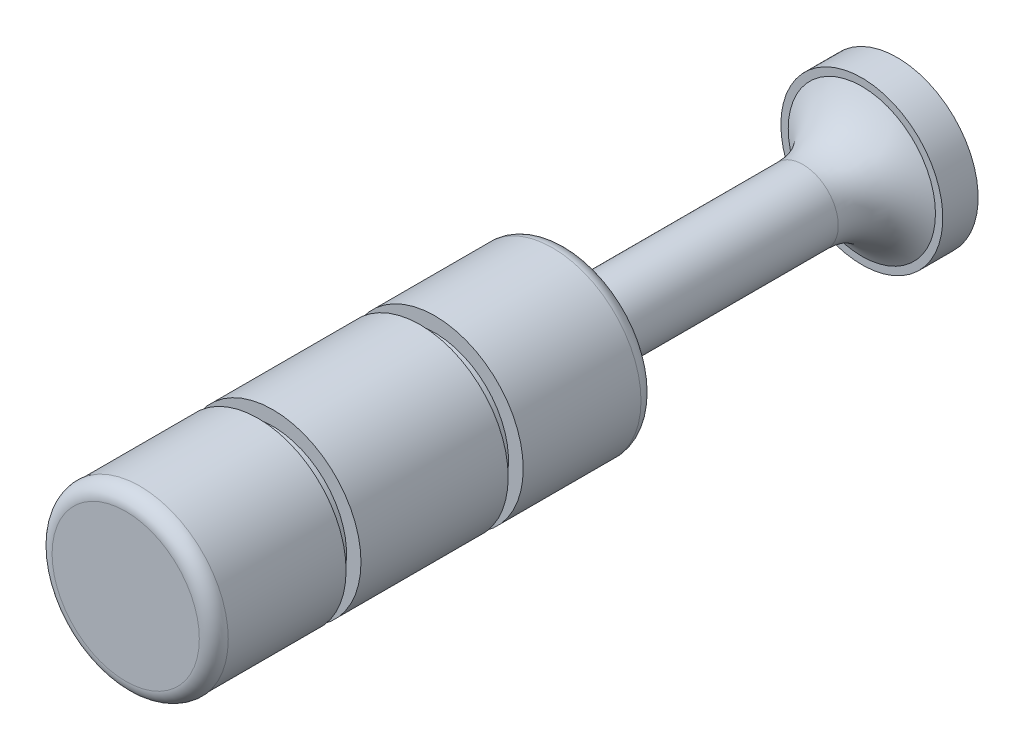
ISO-10303-21;
HEADER;
FILE_DESCRIPTION(('STEP AP214'),'2;1');
FILE_NAME('part.step','',(''),(''),'','','');
FILE_SCHEMA(('AUTOMOTIVE_DESIGN { 1 0 10303 214 1 1 1 1 }'));
ENDSEC;
DATA;
#1=APPLICATION_CONTEXT('core data for automotive mechanical design processes');
#2=APPLICATION_PROTOCOL_DEFINITION('international standard','automotive_design',2000,#1);
#3=PRODUCT_CONTEXT('',#1,'mechanical');
#4=PRODUCT('Part','Part','',(#3));
#5=PRODUCT_RELATED_PRODUCT_CATEGORY('part','',(#4));
#6=PRODUCT_DEFINITION_FORMATION('','',#4);
#7=PRODUCT_DEFINITION_CONTEXT('part definition',#1,'design');
#8=PRODUCT_DEFINITION('design','',#6,#7);
#9=PRODUCT_DEFINITION_SHAPE('','',#8);
#10=(LENGTH_UNIT() NAMED_UNIT(*) SI_UNIT(.MILLI.,.METRE.));
#11=(NAMED_UNIT(*) PLANE_ANGLE_UNIT() SI_UNIT($,.RADIAN.));
#12=(NAMED_UNIT(*) SI_UNIT($,.STERADIAN.) SOLID_ANGLE_UNIT());
#13=UNCERTAINTY_MEASURE_WITH_UNIT(LENGTH_MEASURE(1.E-05),#10,'distance_accuracy_value','');
#14=(GEOMETRIC_REPRESENTATION_CONTEXT(3) GLOBAL_UNCERTAINTY_ASSIGNED_CONTEXT((#13)) GLOBAL_UNIT_ASSIGNED_CONTEXT((#10,
#11,#12)) REPRESENTATION_CONTEXT('',''));
#15=CARTESIAN_POINT('',(0.,0.,0.));
#16=DIRECTION('',(0.,0.,1.));
#17=DIRECTION('',(1.,0.,0.));
#18=AXIS2_PLACEMENT_3D('',#15,#16,#17);
#19=CARTESIAN_POINT('',(0.,0.,-112.));
#20=DIRECTION('',(0.,0.,-1.));
#21=DIRECTION('',(-1.,0.,0.));
#22=AXIS2_PLACEMENT_3D('',#19,#20,#21);
#23=PLANE('',#22);
#24=CARTESIAN_POINT('',(0.,0.,-112.));
#25=DIRECTION('',(0.,0.,-1.));
#26=DIRECTION('',(-1.,0.,0.));
#27=AXIS2_PLACEMENT_3D('',#24,#25,#26);
#28=CIRCLE('',#27,27.5);
#29=CARTESIAN_POINT('',(-27.5,0.,-112.));
#30=VERTEX_POINT('',#29);
#31=EDGE_CURVE('E266',#30,#30,#28,.F.);
#32=ORIENTED_EDGE('',*,*,#31,.F.);
#33=EDGE_LOOP('',(#32));
#34=FACE_BOUND('',#33,.T.);
#35=ADVANCED_FACE('F16',(#34),#23,.T.);
#36=CARTESIAN_POINT('',(0.,0.,-100.));
#37=DIRECTION('',(0.,0.,-1.));
#38=DIRECTION('',(-1.,0.,0.));
#39=AXIS2_PLACEMENT_3D('',#36,#37,#38);
#40=CYLINDRICAL_SURFACE('',#39,27.5);
#41=ORIENTED_EDGE('',*,*,#31,.T.);
#42=EDGE_LOOP('',(#41));
#43=FACE_BOUND('',#42,.T.);
#44=CARTESIAN_POINT('',(0.,0.,-100.));
#45=DIRECTION('',(0.,0.,-1.));
#46=DIRECTION('',(-1.,0.,0.));
#47=AXIS2_PLACEMENT_3D('',#44,#45,#46);
#48=CIRCLE('',#47,27.5);
#49=CARTESIAN_POINT('',(-27.5,0.,-100.));
#50=VERTEX_POINT('',#49);
#51=EDGE_CURVE('E263',#50,#50,#48,.T.);
#52=ORIENTED_EDGE('',*,*,#51,.T.);
#53=EDGE_LOOP('',(#52));
#54=FACE_BOUND('',#53,.T.);
#55=ADVANCED_FACE('F182',(#43,#54),#40,.T.);
#56=CARTESIAN_POINT('',(0.,0.,-100.));
#57=DIRECTION('',(0.,0.,-1.));
#58=DIRECTION('',(-1.,0.,0.));
#59=AXIS2_PLACEMENT_3D('',#56,#57,#58);
#60=PLANE('',#59);
#61=CARTESIAN_POINT('',(0.,0.,-100.));
#62=DIRECTION('',(0.,0.,1.));
#63=DIRECTION('',(1.,0.,0.));
#64=AXIS2_PLACEMENT_3D('',#61,#62,#63);
#65=CIRCLE('',#64,24.9999999999631);
#66=CARTESIAN_POINT('',(24.9999999999631,0.,-100.));
#67=VERTEX_POINT('',#66);
#68=EDGE_CURVE('E168',#67,#67,#65,.T.);
#69=ORIENTED_EDGE('',*,*,#68,.F.);
#70=EDGE_LOOP('',(#69));
#71=FACE_BOUND('',#70,.T.);
#72=ORIENTED_EDGE('',*,*,#51,.F.);
#73=EDGE_LOOP('',(#72));
#74=FACE_BOUND('',#73,.T.);
#75=ADVANCED_FACE('F179',(#71,#74),#60,.F.);
#76=CARTESIAN_POINT('',(0.,12.00127129795,-79.74823270007));
#77=CARTESIAN_POINT('',(0.,12.00042317209,-79.83237085997));
#78=CARTESIAN_POINT('',(0.,11.97749377162,-84.3796697018));
#79=CARTESIAN_POINT('',(0.,14.47676341213,-92.40162845407));
#80=CARTESIAN_POINT('',(0.,20.99160255353,-97.88727807262));
#81=CARTESIAN_POINT('',(0.,25.14864100605,-100.0787003868));
#82=CARTESIAN_POINT('',(0.,25.22332574502,-100.1177295014));
#83=(BOUNDED_CURVE() B_SPLINE_CURVE(3,(#76,#77,#78,#79,#80,#81,#82),.UNSPECIFIED.,.F.,
.F.) B_SPLINE_CURVE_WITH_KNOTS((4,1,1,1,4),(0.,0.008921819196633,0.4834249978162,
0.9907493820845,1.),
.UNSPECIFIED.) CURVE() GEOMETRIC_REPRESENTATION_ITEM() RATIONAL_B_SPLINE_CURVE((1.,1.,1.,1.,1.,
1.,1.)) REPRESENTATION_ITEM(''));
#84=CARTESIAN_POINT('',(0.,0.,5.));
#85=DIRECTION('',(0.,0.,1.));
#86=AXIS1_PLACEMENT('',#84,#85);
#87=SURFACE_OF_REVOLUTION('',#83,#86);
#88=CARTESIAN_POINT('',(0.,0.,-80.));
#89=DIRECTION('',(0.,0.,-1.));
#90=DIRECTION('',(-1.,0.,0.));
#91=AXIS2_PLACEMENT_3D('',#88,#89,#90);
#92=CIRCLE('',#91,12.);
#93=CARTESIAN_POINT('',(-12.,0.,-80.));
#94=VERTEX_POINT('',#93);
#95=EDGE_CURVE('E165',#94,#94,#92,.F.);
#96=ORIENTED_EDGE('',*,*,#95,.F.);
#97=EDGE_LOOP('',(#96));
#98=FACE_BOUND('',#97,.T.);
#99=ORIENTED_EDGE('',*,*,#68,.T.);
#100=EDGE_LOOP('',(#99));
#101=FACE_BOUND('',#100,.T.);
#102=ADVANCED_FACE('F176',(#98,#101),#87,.F.);
#103=CARTESIAN_POINT('',(0.,0.,5.));
#104=DIRECTION('',(0.,0.,-1.));
#105=DIRECTION('',(-1.,0.,0.));
#106=AXIS2_PLACEMENT_3D('',#103,#104,#105);
#107=CYLINDRICAL_SURFACE('',#106,12.);
#108=ORIENTED_EDGE('',*,*,#95,.T.);
#109=EDGE_LOOP('',(#108));
#110=FACE_BOUND('',#109,.T.);
#111=CARTESIAN_POINT('',(0.,0.,-5.));
#112=DIRECTION('',(0.,0.,-1.));
#113=DIRECTION('',(0.0352828354079506,-0.999377366926816,0.));
#114=AXIS2_PLACEMENT_3D('',#111,#112,#113);
#115=CIRCLE('',#114,12.);
#116=CARTESIAN_POINT('',(0.423394024895407,-11.9925284031218,-5.));
#117=VERTEX_POINT('',#116);
#118=EDGE_CURVE('E57',#117,#117,#115,.T.);
#119=ORIENTED_EDGE('',*,*,#118,.T.);
#120=EDGE_LOOP('',(#119));
#121=FACE_BOUND('',#120,.T.);
#122=ADVANCED_FACE('F151',(#110,#121),#107,.T.);
#123=CARTESIAN_POINT('',(0.,0.,-5.));
#124=DIRECTION('',(0.,0.,-1.));
#125=DIRECTION('',(0.0352828354079506,-0.999377366926816,0.));
#126=AXIS2_PLACEMENT_3D('',#123,#124,#125);
#127=TOROIDAL_SURFACE('',#126,17.,5.);
#128=ORIENTED_EDGE('',*,*,#118,.F.);
#129=EDGE_LOOP('',(#128));
#130=FACE_BOUND('',#129,.T.);
#131=CARTESIAN_POINT('',(0.,0.,0.));
#132=DIRECTION('',(0.,0.,-1.));
#133=DIRECTION('',(0.,1.,0.));
#134=AXIS2_PLACEMENT_3D('',#131,#132,#133);
#135=CIRCLE('',#134,17.);
#136=CARTESIAN_POINT('',(0.,17.,0.));
#137=VERTEX_POINT('',#136);
#138=CARTESIAN_POINT('',(0.,-17.,0.));
#139=VERTEX_POINT('',#138);
#140=EDGE_CURVE('E53',#137,#139,#135,.T.);
#141=ORIENTED_EDGE('',*,*,#140,.T.);
#142=CARTESIAN_POINT('',(0.,0.,0.));
#143=DIRECTION('',(0.,0.,-1.));
#144=DIRECTION('',(0.,-1.,0.));
#145=AXIS2_PLACEMENT_3D('',#142,#143,#144);
#146=CIRCLE('',#145,17.);
#147=EDGE_CURVE('E50',#139,#137,#146,.T.);
#148=ORIENTED_EDGE('',*,*,#147,.T.);
#149=EDGE_LOOP('',(#141,#148));
#150=FACE_BOUND('',#149,.T.);
#151=ADVANCED_FACE('F54',(#130,#150),#127,.F.);
#152=CARTESIAN_POINT('',(0.,0.,150.));
#153=DIRECTION('',(0.,0.,1.));
#154=DIRECTION('',(1.,0.,0.));
#155=AXIS2_PLACEMENT_3D('',#152,#153,#154);
#156=PLANE('',#155);
#157=CARTESIAN_POINT('',(0.,0.,150.));
#158=DIRECTION('',(0.,0.,-1.));
#159=DIRECTION('',(1.,9.14699522722162E-12,0.));
#160=AXIS2_PLACEMENT_3D('',#157,#158,#159);
#161=CIRCLE('',#160,25.);
#162=CARTESIAN_POINT('',(25.,9.14721857286915E-11,150.));
#163=VERTEX_POINT('',#162);
#164=CARTESIAN_POINT('',(-25.,0.,150.));
#165=VERTEX_POINT('',#164);
#166=EDGE_CURVE('E108',#163,#165,#161,.T.);
#167=ORIENTED_EDGE('',*,*,#166,.F.);
#168=CARTESIAN_POINT('',(0.,0.,150.));
#169=DIRECTION('',(0.,0.,-1.));
#170=DIRECTION('',(-1.,0.,0.));
#171=AXIS2_PLACEMENT_3D('',#168,#169,#170);
#172=CIRCLE('',#171,25.);
#173=EDGE_CURVE('E62',#165,#163,#172,.T.);
#174=ORIENTED_EDGE('',*,*,#173,.F.);
#175=EDGE_LOOP('',(#167,#174));
#176=FACE_BOUND('',#175,.T.);
#177=ADVANCED_FACE('F82',(#176),#156,.T.);
#178=CARTESIAN_POINT('',(0.,0.,0.));
#179=DIRECTION('',(0.,0.,1.));
#180=DIRECTION('',(1.,0.,0.));
#181=AXIS2_PLACEMENT_3D('',#178,#179,#180);
#182=PLANE('',#181);
#183=ORIENTED_EDGE('',*,*,#140,.F.);
#184=ORIENTED_EDGE('',*,*,#147,.F.);
#185=EDGE_LOOP('',(#183,#184));
#186=FACE_BOUND('',#185,.T.);
#187=CARTESIAN_POINT('',(0.,0.,0.));
#188=DIRECTION('',(0.,0.,1.));
#189=DIRECTION('',(1.,0.,0.));
#190=AXIS2_PLACEMENT_3D('',#187,#188,#189);
#191=CIRCLE('',#190,25.);
#192=CARTESIAN_POINT('',(25.,0.,0.));
#193=VERTEX_POINT('',#192);
#194=CARTESIAN_POINT('',(-25.,0.,0.));
#195=VERTEX_POINT('',#194);
#196=EDGE_CURVE('E35',#193,#195,#191,.T.);
#197=ORIENTED_EDGE('',*,*,#196,.F.);
#198=CARTESIAN_POINT('',(0.,0.,0.));
#199=DIRECTION('',(0.,0.,1.));
#200=DIRECTION('',(-1.,0.,0.));
#201=AXIS2_PLACEMENT_3D('',#198,#199,#200);
#202=CIRCLE('',#201,25.);
#203=EDGE_CURVE('E103',#195,#193,#202,.T.);
#204=ORIENTED_EDGE('',*,*,#203,.F.);
#205=EDGE_LOOP('',(#197,#204));
#206=FACE_BOUND('',#205,.T.);
#207=ADVANCED_FACE('F60',(#186,#206),#182,.F.);
#208=CARTESIAN_POINT('',(0.,0.,145.));
#209=DIRECTION('',(0.,0.,1.));
#210=DIRECTION('',(-0.999900370023055,0.0141155951967494,0.));
#211=AXIS2_PLACEMENT_3D('',#208,#209,#210);
#212=TOROIDAL_SURFACE('',#211,25.,5.);
#213=ORIENTED_EDGE('',*,*,#173,.T.);
#214=ORIENTED_EDGE('',*,*,#166,.T.);
#215=EDGE_LOOP('',(#213,#214));
#216=FACE_BOUND('',#215,.T.);
#217=CARTESIAN_POINT('',(0.,0.,145.1651875419));
#218=DIRECTION('',(0.,0.,1.));
#219=DIRECTION('',(1.,0.,0.));
#220=AXIS2_PLACEMENT_3D('',#217,#218,#219);
#221=CIRCLE('',#220,29.9972705626173);
#222=CARTESIAN_POINT('',(29.9972705626173,0.,145.1651875419));
#223=VERTEX_POINT('',#222);
#224=EDGE_CURVE('E104',#223,#223,#221,.F.);
#225=ORIENTED_EDGE('',*,*,#224,.F.);
#226=EDGE_LOOP('',(#225));
#227=FACE_BOUND('',#226,.T.);
#228=ADVANCED_FACE('F81',(#216,#227),#212,.T.);
#229=CARTESIAN_POINT('',(0.,0.,5.));
#230=DIRECTION('',(0.,0.,1.));
#231=DIRECTION('',(0.999798952263747,0.0200513104886809,0.));
#232=AXIS2_PLACEMENT_3D('',#229,#230,#231);
#233=TOROIDAL_SURFACE('',#232,25.,5.);
#234=CARTESIAN_POINT('',(0.,0.,5.));
#235=DIRECTION('',(0.,0.,1.));
#236=DIRECTION('',(1.,0.,0.));
#237=AXIS2_PLACEMENT_3D('',#234,#235,#236);
#238=CIRCLE('',#237,30.);
#239=CARTESIAN_POINT('',(30.,0.,5.));
#240=VERTEX_POINT('',#239);
#241=EDGE_CURVE('E106',#240,#240,#238,.T.);
#242=ORIENTED_EDGE('',*,*,#241,.F.);
#243=EDGE_LOOP('',(#242));
#244=FACE_BOUND('',#243,.T.);
#245=ORIENTED_EDGE('',*,*,#203,.T.);
#246=ORIENTED_EDGE('',*,*,#196,.T.);
#247=EDGE_LOOP('',(#245,#246));
#248=FACE_BOUND('',#247,.T.);
#249=ADVANCED_FACE('F238',(#244,#248),#233,.T.);
#250=CARTESIAN_POINT('',(0.,0.,145.1651875419));
#251=DIRECTION('',(0.,0.,-1.));
#252=DIRECTION('',(-1.,0.,0.));
#253=AXIS2_PLACEMENT_3D('',#250,#251,#252);
#254=PLANE('',#253);
#255=CARTESIAN_POINT('',(0.,0.,145.1651875419));
#256=DIRECTION('',(0.,0.,-1.));
#257=DIRECTION('',(-1.,0.,0.));
#258=AXIS2_PLACEMENT_3D('',#255,#256,#257);
#259=CIRCLE('',#258,29.85);
#260=CARTESIAN_POINT('',(-29.85,0.,145.1651875419));
#261=VERTEX_POINT('',#260);
#262=EDGE_CURVE('E248',#261,#261,#259,.T.);
#263=ORIENTED_EDGE('',*,*,#262,.F.);
#264=EDGE_LOOP('',(#263));
#265=FACE_BOUND('',#264,.T.);
#266=ORIENTED_EDGE('',*,*,#224,.T.);
#267=EDGE_LOOP('',(#266));
#268=FACE_BOUND('',#267,.T.);
#269=ADVANCED_FACE('F235',(#265,#268),#254,.T.);
#270=CARTESIAN_POINT('',(0.,0.,0.));
#271=DIRECTION('',(0.,0.,1.));
#272=DIRECTION('',(1.,0.,0.));
#273=AXIS2_PLACEMENT_3D('',#270,#271,#272);
#274=CYLINDRICAL_SURFACE('',#273,30.);
#275=CARTESIAN_POINT('',(0.,0.,45.));
#276=DIRECTION('',(0.,0.,1.));
#277=DIRECTION('',(1.,0.,0.));
#278=AXIS2_PLACEMENT_3D('',#275,#276,#277);
#279=CIRCLE('',#278,30.);
#280=CARTESIAN_POINT('',(30.,0.,45.));
#281=VERTEX_POINT('',#280);
#282=EDGE_CURVE('E253',#281,#281,#279,.F.);
#283=ORIENTED_EDGE('',*,*,#282,.T.);
#284=EDGE_LOOP('',(#283));
#285=FACE_BOUND('',#284,.T.);
#286=ORIENTED_EDGE('',*,*,#241,.T.);
#287=EDGE_LOOP('',(#286));
#288=FACE_BOUND('',#287,.T.);
#289=ADVANCED_FACE('F232',(#285,#288),#274,.T.);
#290=CARTESIAN_POINT('',(0.,0.,149.923446919));
#291=DIRECTION('',(0.,0.,-1.));
#292=DIRECTION('',(-1.,0.,0.));
#293=AXIS2_PLACEMENT_3D('',#290,#291,#292);
#294=CYLINDRICAL_SURFACE('',#293,29.85);
#295=ORIENTED_EDGE('',*,*,#262,.T.);
#296=EDGE_LOOP('',(#295));
#297=FACE_BOUND('',#296,.T.);
#298=CARTESIAN_POINT('',(0.,0.,105.));
#299=DIRECTION('',(0.,0.,-1.));
#300=DIRECTION('',(-1.,0.,0.));
#301=AXIS2_PLACEMENT_3D('',#298,#299,#300);
#302=CIRCLE('',#301,29.85);
#303=CARTESIAN_POINT('',(-29.85,0.,105.));
#304=VERTEX_POINT('',#303);
#305=EDGE_CURVE('E257',#304,#304,#302,.T.);
#306=ORIENTED_EDGE('',*,*,#305,.F.);
#307=EDGE_LOOP('',(#306));
#308=FACE_BOUND('',#307,.T.);
#309=ADVANCED_FACE('F228',(#297,#308),#294,.T.);
#310=CARTESIAN_POINT('',(0.,0.,45.));
#311=DIRECTION('',(0.,0.,-1.));
#312=DIRECTION('',(-1.,0.,0.));
#313=AXIS2_PLACEMENT_3D('',#310,#311,#312);
#314=PLANE('',#313);
#315=CARTESIAN_POINT('',(0.,0.,45.));
#316=DIRECTION('',(0.,0.,-1.));
#317=DIRECTION('',(-1.,0.,0.));
#318=AXIS2_PLACEMENT_3D('',#315,#316,#317);
#319=CIRCLE('',#318,25.);
#320=CARTESIAN_POINT('',(-25.,0.,45.));
#321=VERTEX_POINT('',#320);
#322=EDGE_CURVE('E281',#321,#321,#319,.F.);
#323=ORIENTED_EDGE('',*,*,#322,.F.);
#324=EDGE_LOOP('',(#323));
#325=FACE_BOUND('',#324,.T.);
#326=ORIENTED_EDGE('',*,*,#282,.F.);
#327=EDGE_LOOP('',(#326));
#328=FACE_BOUND('',#327,.T.);
#329=ADVANCED_FACE('F224',(#325,#328),#314,.F.);
#330=CARTESIAN_POINT('',(0.,0.,105.));
#331=DIRECTION('',(0.,0.,-1.));
#332=DIRECTION('',(-1.,0.,0.));
#333=AXIS2_PLACEMENT_3D('',#330,#331,#332);
#334=PLANE('',#333);
#335=CARTESIAN_POINT('',(0.,0.,105.));
#336=DIRECTION('',(0.,0.,-1.));
#337=DIRECTION('',(-1.,0.,0.));
#338=AXIS2_PLACEMENT_3D('',#335,#336,#337);
#339=CIRCLE('',#338,25.);
#340=CARTESIAN_POINT('',(-25.,0.,105.));
#341=VERTEX_POINT('',#340);
#342=EDGE_CURVE('E284',#341,#341,#339,.T.);
#343=ORIENTED_EDGE('',*,*,#342,.F.);
#344=EDGE_LOOP('',(#343));
#345=FACE_BOUND('',#344,.T.);
#346=ORIENTED_EDGE('',*,*,#305,.T.);
#347=EDGE_LOOP('',(#346));
#348=FACE_BOUND('',#347,.T.);
#349=ADVANCED_FACE('F220',(#345,#348),#334,.T.);
#350=CARTESIAN_POINT('',(0.,0.,108.));
#351=DIRECTION('',(0.,0.,-1.));
#352=DIRECTION('',(-1.,0.,0.));
#353=AXIS2_PLACEMENT_3D('',#350,#351,#352);
#354=CYLINDRICAL_SURFACE('',#353,25.);
#355=ORIENTED_EDGE('',*,*,#322,.T.);
#356=EDGE_LOOP('',(#355));
#357=FACE_BOUND('',#356,.T.);
#358=CARTESIAN_POINT('',(0.,0.,50.));
#359=DIRECTION('',(0.,0.,-1.));
#360=DIRECTION('',(-1.,0.,0.));
#361=AXIS2_PLACEMENT_3D('',#358,#359,#360);
#362=CIRCLE('',#361,25.);
#363=CARTESIAN_POINT('',(-25.,0.,50.));
#364=VERTEX_POINT('',#363);
#365=EDGE_CURVE('E287',#364,#364,#362,.F.);
#366=ORIENTED_EDGE('',*,*,#365,.F.);
#367=EDGE_LOOP('',(#366));
#368=FACE_BOUND('',#367,.T.);
#369=ADVANCED_FACE('F216',(#357,#368),#354,.T.);
#370=CARTESIAN_POINT('',(0.,0.,108.));
#371=DIRECTION('',(0.,0.,-1.));
#372=DIRECTION('',(-1.,0.,0.));
#373=AXIS2_PLACEMENT_3D('',#370,#371,#372);
#374=CYLINDRICAL_SURFACE('',#373,25.);
#375=CARTESIAN_POINT('',(0.,0.,100.));
#376=DIRECTION('',(0.,0.,-1.));
#377=DIRECTION('',(-1.,0.,0.));
#378=AXIS2_PLACEMENT_3D('',#375,#376,#377);
#379=CIRCLE('',#378,25.);
#380=CARTESIAN_POINT('',(-25.,0.,100.));
#381=VERTEX_POINT('',#380);
#382=EDGE_CURVE('E290',#381,#381,#379,.F.);
#383=ORIENTED_EDGE('',*,*,#382,.T.);
#384=EDGE_LOOP('',(#383));
#385=FACE_BOUND('',#384,.T.);
#386=ORIENTED_EDGE('',*,*,#342,.T.);
#387=EDGE_LOOP('',(#386));
#388=FACE_BOUND('',#387,.T.);
#389=ADVANCED_FACE('F212',(#385,#388),#374,.T.);
#390=CARTESIAN_POINT('',(0.,0.,50.));
#391=DIRECTION('',(0.,0.,-1.));
#392=DIRECTION('',(-1.,0.,0.));
#393=AXIS2_PLACEMENT_3D('',#390,#391,#392);
#394=PLANE('',#393);
#395=ORIENTED_EDGE('',*,*,#365,.T.);
#396=EDGE_LOOP('',(#395));
#397=FACE_BOUND('',#396,.T.);
#398=CARTESIAN_POINT('',(0.,0.,50.));
#399=DIRECTION('',(0.,0.,-1.));
#400=DIRECTION('',(-1.,0.,0.));
#401=AXIS2_PLACEMENT_3D('',#398,#399,#400);
#402=CIRCLE('',#401,29.9);
#403=CARTESIAN_POINT('',(-29.9,0.,50.));
#404=VERTEX_POINT('',#403);
#405=EDGE_CURVE('E27',#404,#404,#402,.F.);
#406=ORIENTED_EDGE('',*,*,#405,.F.);
#407=EDGE_LOOP('',(#406));
#408=FACE_BOUND('',#407,.T.);
#409=ADVANCED_FACE('F204',(#397,#408),#394,.T.);
#410=CARTESIAN_POINT('',(0.,0.,100.));
#411=DIRECTION('',(0.,0.,-1.));
#412=DIRECTION('',(-1.,0.,0.));
#413=AXIS2_PLACEMENT_3D('',#410,#411,#412);
#414=PLANE('',#413);
#415=ORIENTED_EDGE('',*,*,#382,.F.);
#416=EDGE_LOOP('',(#415));
#417=FACE_BOUND('',#416,.T.);
#418=CARTESIAN_POINT('',(0.,0.,100.));
#419=DIRECTION('',(0.,0.,-1.));
#420=DIRECTION('',(-1.,0.,0.));
#421=AXIS2_PLACEMENT_3D('',#418,#419,#420);
#422=CIRCLE('',#421,29.9);
#423=CARTESIAN_POINT('',(-29.9,0.,100.));
#424=VERTEX_POINT('',#423);
#425=EDGE_CURVE('E11',#424,#424,#422,.T.);
#426=ORIENTED_EDGE('',*,*,#425,.F.);
#427=EDGE_LOOP('',(#426));
#428=FACE_BOUND('',#427,.T.);
#429=ADVANCED_FACE('F195',(#417,#428),#414,.F.);
#430=CARTESIAN_POINT('',(0.,0.,149.923446919));
#431=DIRECTION('',(0.,0.,-1.));
#432=DIRECTION('',(-1.,0.,0.));
#433=AXIS2_PLACEMENT_3D('',#430,#431,#432);
#434=CYLINDRICAL_SURFACE('',#433,29.9);
#435=ORIENTED_EDGE('',*,*,#405,.T.);
#436=EDGE_LOOP('',(#435));
#437=FACE_BOUND('',#436,.T.);
#438=ORIENTED_EDGE('',*,*,#425,.T.);
#439=EDGE_LOOP('',(#438));
#440=FACE_BOUND('',#439,.T.);
#441=ADVANCED_FACE('F193',(#437,#440),#434,.T.);
#442=CLOSED_SHELL('',(#35,#55,#75,#102,#122,#151,#177,#207,#228,#249,#269,#289,#309,#329,#349,
#369,#389,#409,#429,#441));
#443=MANIFOLD_SOLID_BREP('B1',#442);
#444=ADVANCED_BREP_SHAPE_REPRESENTATION('',(#18,#443),#14);
#445=SHAPE_DEFINITION_REPRESENTATION(#9,#444);
ENDSEC;
END-ISO-10303-21;
